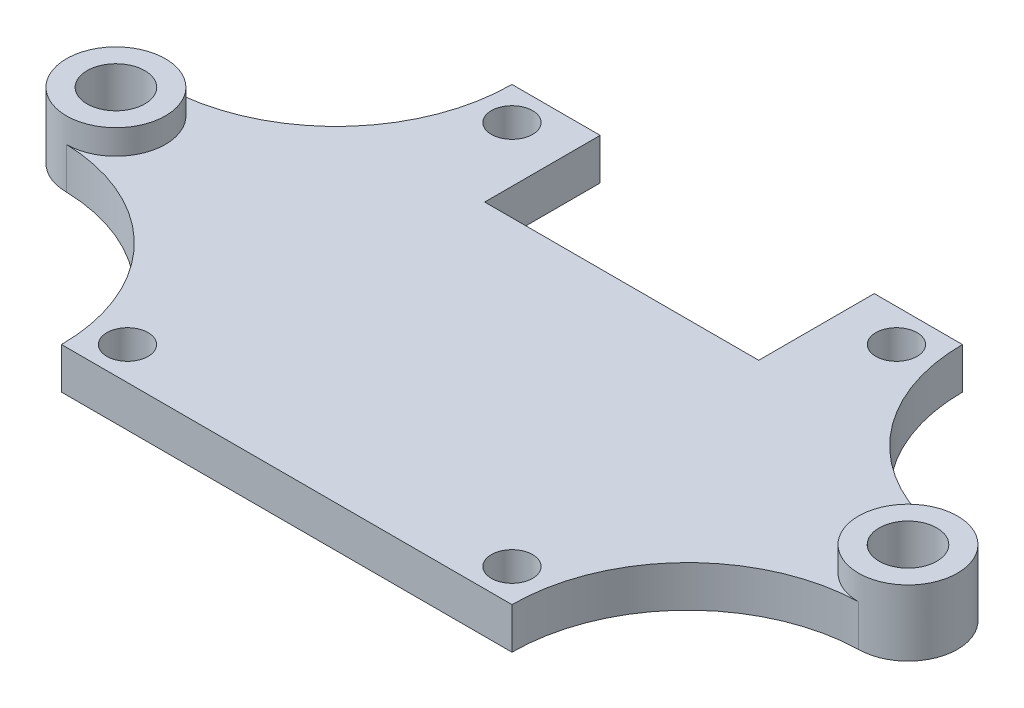
ISO-10303-21;
HEADER;
FILE_DESCRIPTION(('STEP AP214'),'2;1');
FILE_NAME('part.step','',(''),(''),'','','');
FILE_SCHEMA(('AUTOMOTIVE_DESIGN { 1 0 10303 214 1 1 1 1 }'));
ENDSEC;
DATA;
#1=APPLICATION_CONTEXT('core data for automotive mechanical design processes');
#2=APPLICATION_PROTOCOL_DEFINITION('international standard','automotive_design',2000,#1);
#3=PRODUCT_CONTEXT('',#1,'mechanical');
#4=PRODUCT('Part','Part','',(#3));
#5=PRODUCT_RELATED_PRODUCT_CATEGORY('part','',(#4));
#6=PRODUCT_DEFINITION_FORMATION('','',#4);
#7=PRODUCT_DEFINITION_CONTEXT('part definition',#1,'design');
#8=PRODUCT_DEFINITION('design','',#6,#7);
#9=PRODUCT_DEFINITION_SHAPE('','',#8);
#10=(LENGTH_UNIT() NAMED_UNIT(*) SI_UNIT(.MILLI.,.METRE.));
#11=(NAMED_UNIT(*) PLANE_ANGLE_UNIT() SI_UNIT($,.RADIAN.));
#12=(NAMED_UNIT(*) SI_UNIT($,.STERADIAN.) SOLID_ANGLE_UNIT());
#13=UNCERTAINTY_MEASURE_WITH_UNIT(LENGTH_MEASURE(1.E-05),#10,'distance_accuracy_value','');
#14=(GEOMETRIC_REPRESENTATION_CONTEXT(3) GLOBAL_UNCERTAINTY_ASSIGNED_CONTEXT((#13)) GLOBAL_UNIT_ASSIGNED_CONTEXT((#10,
#11,#12)) REPRESENTATION_CONTEXT('',''));
#15=CARTESIAN_POINT('',(0.,0.,0.));
#16=DIRECTION('',(0.,0.,1.));
#17=DIRECTION('',(1.,0.,0.));
#18=AXIS2_PLACEMENT_3D('',#15,#16,#17);
#19=CARTESIAN_POINT('',(0.,2.5,-27.3));
#20=DIRECTION('',(0.,0.,-1.));
#21=DIRECTION('',(-1.,0.,0.));
#22=AXIS2_PLACEMENT_3D('',#19,#20,#21);
#23=PLANE('',#22);
#24=DIRECTION('',(0.,1.,0.));
#25=VECTOR('',#24,1.);
#26=CARTESIAN_POINT('',(5.34565217391304,-0.75,-27.3));
#27=LINE('',#26,#25);
#28=CARTESIAN_POINT('',(5.34565217391304,0.,-27.3));
#29=VERTEX_POINT('',#28);
#30=CARTESIAN_POINT('',(5.34565217391304,2.5,-27.3));
#31=VERTEX_POINT('',#30);
#32=EDGE_CURVE('E159',#29,#31,#27,.T.);
#33=ORIENTED_EDGE('',*,*,#32,.F.);
#34=DIRECTION('',(1.,0.,0.));
#35=VECTOR('',#34,1.);
#36=CARTESIAN_POINT('',(0.,0.,-27.3));
#37=LINE('',#36,#35);
#38=CARTESIAN_POINT('',(0.,0.,-27.3));
#39=VERTEX_POINT('',#38);
#40=EDGE_CURVE('E282',#39,#29,#37,.T.);
#41=ORIENTED_EDGE('',*,*,#40,.F.);
#42=DIRECTION('',(0.,-1.,0.));
#43=VECTOR('',#42,1.);
#44=CARTESIAN_POINT('',(0.,2.5,-27.3));
#45=LINE('',#44,#43);
#46=CARTESIAN_POINT('',(0.,2.5,-27.3));
#47=VERTEX_POINT('',#46);
#48=EDGE_CURVE('E303',#47,#39,#45,.T.);
#49=ORIENTED_EDGE('',*,*,#48,.F.);
#50=DIRECTION('',(1.,0.,0.));
#51=VECTOR('',#50,1.);
#52=CARTESIAN_POINT('',(0.,2.5,-27.3));
#53=LINE('',#52,#51);
#54=EDGE_CURVE('E242',#47,#31,#53,.T.);
#55=ORIENTED_EDGE('',*,*,#54,.T.);
#56=EDGE_LOOP('',(#33,#41,#49,#55));
#57=FACE_BOUND('',#56,.T.);
#58=ADVANCED_FACE('F45',(#57),#23,.T.);
#59=CARTESIAN_POINT('',(0.,2.5,0.));
#60=DIRECTION('',(0.,0.,-1.));
#61=DIRECTION('',(-1.,0.,0.));
#62=AXIS2_PLACEMENT_3D('',#59,#60,#61);
#63=PLANE('',#62);
#64=DIRECTION('',(1.,0.,0.));
#65=VECTOR('',#64,1.);
#66=CARTESIAN_POINT('',(0.,0.,0.));
#67=LINE('',#66,#65);
#68=CARTESIAN_POINT('',(0.,0.,0.));
#69=VERTEX_POINT('',#68);
#70=CARTESIAN_POINT('',(27.3,0.,0.));
#71=VERTEX_POINT('',#70);
#72=EDGE_CURVE('E270',#69,#71,#67,.T.);
#73=ORIENTED_EDGE('',*,*,#72,.T.);
#74=DIRECTION('',(0.,-1.,0.));
#75=VECTOR('',#74,1.);
#76=CARTESIAN_POINT('',(27.3,2.5,0.));
#77=LINE('',#76,#75);
#78=CARTESIAN_POINT('',(27.3,2.5,0.));
#79=VERTEX_POINT('',#78);
#80=EDGE_CURVE('E318',#79,#71,#77,.T.);
#81=ORIENTED_EDGE('',*,*,#80,.F.);
#82=DIRECTION('',(1.,0.,0.));
#83=VECTOR('',#82,1.);
#84=CARTESIAN_POINT('',(0.,2.5,0.));
#85=LINE('',#84,#83);
#86=CARTESIAN_POINT('',(0.,2.5,0.));
#87=VERTEX_POINT('',#86);
#88=EDGE_CURVE('E229',#87,#79,#85,.T.);
#89=ORIENTED_EDGE('',*,*,#88,.F.);
#90=DIRECTION('',(0.,-1.,0.));
#91=VECTOR('',#90,1.);
#92=CARTESIAN_POINT('',(0.,2.5,0.));
#93=LINE('',#92,#91);
#94=EDGE_CURVE('E70',#87,#69,#93,.T.);
#95=ORIENTED_EDGE('',*,*,#94,.T.);
#96=EDGE_LOOP('',(#73,#81,#89,#95));
#97=FACE_BOUND('',#96,.T.);
#98=ADVANCED_FACE('F343',(#97),#63,.F.);
#99=CARTESIAN_POINT('',(37.954347826087,2.5,0.));
#100=DIRECTION('',(0.,-1.,0.));
#101=DIRECTION('',(0.,0.,-1.));
#102=AXIS2_PLACEMENT_3D('',#99,#100,#101);
#103=CYLINDRICAL_SURFACE('',#102,10.654347826087);
#104=CARTESIAN_POINT('',(37.954347826087,0.,0.));
#105=DIRECTION('',(0.,1.,0.));
#106=DIRECTION('',(0.,0.,1.));
#107=AXIS2_PLACEMENT_3D('',#104,#105,#106);
#108=CIRCLE('',#107,10.654347826087);
#109=CARTESIAN_POINT('',(37.6499999999999,0.,-10.65));
#110=VERTEX_POINT('',#109);
#111=EDGE_CURVE('E273',#71,#110,#108,.F.);
#112=ORIENTED_EDGE('',*,*,#111,.T.);
#113=DIRECTION('',(0.,-1.,0.));
#114=VECTOR('',#113,1.);
#115=CARTESIAN_POINT('',(37.6499999999999,2.5,-10.65));
#116=LINE('',#115,#114);
#117=CARTESIAN_POINT('',(37.65,2.5,-10.65));
#118=VERTEX_POINT('',#117);
#119=EDGE_CURVE('E314',#118,#110,#116,.T.);
#120=ORIENTED_EDGE('',*,*,#119,.F.);
#121=CARTESIAN_POINT('',(37.954347826087,2.5,0.));
#122=DIRECTION('',(0.,1.,0.));
#123=DIRECTION('',(0.,0.,1.));
#124=AXIS2_PLACEMENT_3D('',#121,#122,#123);
#125=CIRCLE('',#124,10.654347826087);
#126=EDGE_CURVE('E103',#79,#118,#125,.F.);
#127=ORIENTED_EDGE('',*,*,#126,.F.);
#128=ORIENTED_EDGE('',*,*,#80,.T.);
#129=EDGE_LOOP('',(#112,#120,#127,#128));
#130=FACE_BOUND('',#129,.T.);
#131=ADVANCED_FACE('F342',(#130),#103,.F.);
#132=CARTESIAN_POINT('',(37.954347826087,2.5,-27.3));
#133=DIRECTION('',(0.,-1.,0.));
#134=DIRECTION('',(0.,0.,-1.));
#135=AXIS2_PLACEMENT_3D('',#132,#133,#134);
#136=CYLINDRICAL_SURFACE('',#135,10.654347826087);
#137=CARTESIAN_POINT('',(37.954347826087,0.,-27.3));
#138=DIRECTION('',(0.,1.,0.));
#139=DIRECTION('',(0.,0.,1.));
#140=AXIS2_PLACEMENT_3D('',#137,#138,#139);
#141=CIRCLE('',#140,10.654347826087);
#142=CARTESIAN_POINT('',(27.3,0.,-27.3));
#143=VERTEX_POINT('',#142);
#144=CARTESIAN_POINT('',(37.65,0.,-16.65));
#145=VERTEX_POINT('',#144);
#146=EDGE_CURVE('E277',#143,#145,#141,.T.);
#147=ORIENTED_EDGE('',*,*,#146,.F.);
#148=DIRECTION('',(0.,-1.,0.));
#149=VECTOR('',#148,1.);
#150=CARTESIAN_POINT('',(27.3,2.5,-27.3));
#151=LINE('',#150,#149);
#152=CARTESIAN_POINT('',(27.3,2.5,-27.3));
#153=VERTEX_POINT('',#152);
#154=EDGE_CURVE('E306',#153,#143,#151,.T.);
#155=ORIENTED_EDGE('',*,*,#154,.F.);
#156=CARTESIAN_POINT('',(37.954347826087,2.5,-27.3));
#157=DIRECTION('',(0.,1.,0.));
#158=DIRECTION('',(0.,0.,1.));
#159=AXIS2_PLACEMENT_3D('',#156,#157,#158);
#160=CIRCLE('',#159,10.654347826087);
#161=CARTESIAN_POINT('',(37.6499999999998,2.5,-16.65));
#162=VERTEX_POINT('',#161);
#163=EDGE_CURVE('E237',#153,#162,#160,.T.);
#164=ORIENTED_EDGE('',*,*,#163,.T.);
#165=DIRECTION('',(0.,-1.,0.));
#166=VECTOR('',#165,1.);
#167=CARTESIAN_POINT('',(37.6499999999998,2.5,-16.65));
#168=LINE('',#167,#166);
#169=EDGE_CURVE('E310',#162,#145,#168,.T.);
#170=ORIENTED_EDGE('',*,*,#169,.T.);
#171=EDGE_LOOP('',(#147,#155,#164,#170));
#172=FACE_BOUND('',#171,.T.);
#173=ADVANCED_FACE('F337',(#172),#136,.F.);
#174=DIRECTION('',(0.,1.,0.));
#175=VECTOR('',#174,1.);
#176=CARTESIAN_POINT('',(21.954347826087,-0.75,-27.3));
#177=LINE('',#176,#175);
#178=CARTESIAN_POINT('',(21.954347826087,0.,-27.3));
#179=VERTEX_POINT('',#178);
#180=CARTESIAN_POINT('',(21.954347826087,2.5,-27.3));
#181=VERTEX_POINT('',#180);
#182=EDGE_CURVE('E176',#179,#181,#177,.T.);
#183=ORIENTED_EDGE('',*,*,#182,.T.);
#184=EDGE_CURVE('E241',#181,#153,#53,.T.);
#185=ORIENTED_EDGE('',*,*,#184,.T.);
#186=ORIENTED_EDGE('',*,*,#154,.T.);
#187=EDGE_CURVE('E281',#179,#143,#37,.T.);
#188=ORIENTED_EDGE('',*,*,#187,.F.);
#189=EDGE_LOOP('',(#183,#185,#186,#188));
#190=FACE_BOUND('',#189,.T.);
#191=ADVANCED_FACE('F330',(#190),#23,.T.);
#192=CARTESIAN_POINT('',(-10.654347826087,2.5,-27.3));
#193=DIRECTION('',(0.,-1.,0.));
#194=DIRECTION('',(0.,0.,-1.));
#195=AXIS2_PLACEMENT_3D('',#192,#193,#194);
#196=CYLINDRICAL_SURFACE('',#195,10.654347826087);
#197=CARTESIAN_POINT('',(-10.654347826087,0.,-27.3));
#198=DIRECTION('',(0.,1.,0.));
#199=DIRECTION('',(0.,0.,1.));
#200=AXIS2_PLACEMENT_3D('',#197,#198,#199);
#201=CIRCLE('',#200,10.654347826087);
#202=CARTESIAN_POINT('',(-10.35,0.,-16.65));
#203=VERTEX_POINT('',#202);
#204=EDGE_CURVE('E286',#39,#203,#201,.F.);
#205=ORIENTED_EDGE('',*,*,#204,.T.);
#206=DIRECTION('',(0.,-1.,0.));
#207=VECTOR('',#206,1.);
#208=CARTESIAN_POINT('',(-10.35,2.5,-16.65));
#209=LINE('',#208,#207);
#210=CARTESIAN_POINT('',(-10.35,2.5,-16.65));
#211=VERTEX_POINT('',#210);
#212=EDGE_CURVE('E299',#211,#203,#209,.T.);
#213=ORIENTED_EDGE('',*,*,#212,.F.);
#214=CARTESIAN_POINT('',(-10.654347826087,2.5,-27.3));
#215=DIRECTION('',(0.,1.,0.));
#216=DIRECTION('',(0.,0.,1.));
#217=AXIS2_PLACEMENT_3D('',#214,#215,#216);
#218=CIRCLE('',#217,10.654347826087);
#219=EDGE_CURVE('E245',#47,#211,#218,.F.);
#220=ORIENTED_EDGE('',*,*,#219,.F.);
#221=ORIENTED_EDGE('',*,*,#48,.T.);
#222=EDGE_LOOP('',(#205,#213,#220,#221));
#223=FACE_BOUND('',#222,.T.);
#224=ADVANCED_FACE('F359',(#223),#196,.F.);
#225=CARTESIAN_POINT('',(2.,2.5,-25.3));
#226=DIRECTION('',(0.,-1.,0.));
#227=DIRECTION('',(0.,0.,-1.));
#228=AXIS2_PLACEMENT_3D('',#225,#226,#227);
#229=CYLINDRICAL_SURFACE('',#228,1.25);
#230=CARTESIAN_POINT('',(2.,2.5,-25.3));
#231=DIRECTION('',(0.,1.,0.));
#232=DIRECTION('',(0.,0.,1.));
#233=AXIS2_PLACEMENT_3D('',#230,#231,#232);
#234=CIRCLE('',#233,1.25);
#235=CARTESIAN_POINT('',(2.,2.5,-24.05));
#236=VERTEX_POINT('',#235);
#237=EDGE_CURVE('E225',#236,#236,#234,.T.);
#238=ORIENTED_EDGE('',*,*,#237,.T.);
#239=EDGE_LOOP('',(#238));
#240=FACE_BOUND('',#239,.T.);
#241=CARTESIAN_POINT('',(2.,0.,-25.3));
#242=DIRECTION('',(0.,1.,0.));
#243=DIRECTION('',(0.,0.,1.));
#244=AXIS2_PLACEMENT_3D('',#241,#242,#243);
#245=CIRCLE('',#244,1.25);
#246=CARTESIAN_POINT('',(2.,0.,-24.05));
#247=VERTEX_POINT('',#246);
#248=EDGE_CURVE('E266',#247,#247,#245,.T.);
#249=ORIENTED_EDGE('',*,*,#248,.F.);
#250=EDGE_LOOP('',(#249));
#251=FACE_BOUND('',#250,.T.);
#252=ADVANCED_FACE('F356',(#240,#251),#229,.F.);
#253=CARTESIAN_POINT('',(25.3,2.5,-2.));
#254=DIRECTION('',(0.,-1.,0.));
#255=DIRECTION('',(0.,0.,-1.));
#256=AXIS2_PLACEMENT_3D('',#253,#254,#255);
#257=CYLINDRICAL_SURFACE('',#256,1.25);
#258=CARTESIAN_POINT('',(25.3,2.5,-2.));
#259=DIRECTION('',(0.,1.,0.));
#260=DIRECTION('',(0.,0.,1.));
#261=AXIS2_PLACEMENT_3D('',#258,#259,#260);
#262=CIRCLE('',#261,1.25);
#263=CARTESIAN_POINT('',(25.3,2.5,-0.750000000000001));
#264=VERTEX_POINT('',#263);
#265=EDGE_CURVE('E221',#264,#264,#262,.T.);
#266=ORIENTED_EDGE('',*,*,#265,.T.);
#267=EDGE_LOOP('',(#266));
#268=FACE_BOUND('',#267,.T.);
#269=CARTESIAN_POINT('',(25.3,0.,-2.));
#270=DIRECTION('',(0.,1.,0.));
#271=DIRECTION('',(0.,0.,1.));
#272=AXIS2_PLACEMENT_3D('',#269,#270,#271);
#273=CIRCLE('',#272,1.25);
#274=CARTESIAN_POINT('',(25.3,0.,-0.750000000000001));
#275=VERTEX_POINT('',#274);
#276=EDGE_CURVE('E262',#275,#275,#273,.T.);
#277=ORIENTED_EDGE('',*,*,#276,.F.);
#278=EDGE_LOOP('',(#277));
#279=FACE_BOUND('',#278,.T.);
#280=ADVANCED_FACE('F358',(#268,#279),#257,.F.);
#281=CARTESIAN_POINT('',(25.3,2.5,-25.3));
#282=DIRECTION('',(0.,-1.,0.));
#283=DIRECTION('',(0.,0.,-1.));
#284=AXIS2_PLACEMENT_3D('',#281,#282,#283);
#285=CYLINDRICAL_SURFACE('',#284,1.25);
#286=CARTESIAN_POINT('',(25.3,2.5,-25.3));
#287=DIRECTION('',(0.,1.,0.));
#288=DIRECTION('',(0.,0.,1.));
#289=AXIS2_PLACEMENT_3D('',#286,#287,#288);
#290=CIRCLE('',#289,1.25);
#291=CARTESIAN_POINT('',(25.3,2.5,-24.05));
#292=VERTEX_POINT('',#291);
#293=EDGE_CURVE('E216',#292,#292,#290,.T.);
#294=ORIENTED_EDGE('',*,*,#293,.T.);
#295=EDGE_LOOP('',(#294));
#296=FACE_BOUND('',#295,.T.);
#297=CARTESIAN_POINT('',(25.3,0.,-25.3));
#298=DIRECTION('',(0.,1.,0.));
#299=DIRECTION('',(0.,0.,1.));
#300=AXIS2_PLACEMENT_3D('',#297,#298,#299);
#301=CIRCLE('',#300,1.25);
#302=CARTESIAN_POINT('',(25.3,0.,-24.05));
#303=VERTEX_POINT('',#302);
#304=EDGE_CURVE('E258',#303,#303,#301,.T.);
#305=ORIENTED_EDGE('',*,*,#304,.F.);
#306=EDGE_LOOP('',(#305));
#307=FACE_BOUND('',#306,.T.);
#308=ADVANCED_FACE('F362',(#296,#307),#285,.F.);
#309=CARTESIAN_POINT('',(2.,2.5,-2.));
#310=DIRECTION('',(0.,-1.,0.));
#311=DIRECTION('',(0.,0.,-1.));
#312=AXIS2_PLACEMENT_3D('',#309,#310,#311);
#313=CYLINDRICAL_SURFACE('',#312,1.25);
#314=CARTESIAN_POINT('',(2.,2.5,-2.));
#315=DIRECTION('',(0.,1.,0.));
#316=DIRECTION('',(0.,0.,1.));
#317=AXIS2_PLACEMENT_3D('',#314,#315,#316);
#318=CIRCLE('',#317,1.25);
#319=CARTESIAN_POINT('',(2.,2.5,-0.750000000000002));
#320=VERTEX_POINT('',#319);
#321=EDGE_CURVE('E212',#320,#320,#318,.T.);
#322=ORIENTED_EDGE('',*,*,#321,.T.);
#323=EDGE_LOOP('',(#322));
#324=FACE_BOUND('',#323,.T.);
#325=CARTESIAN_POINT('',(2.,0.,-2.));
#326=DIRECTION('',(0.,1.,0.));
#327=DIRECTION('',(0.,0.,1.));
#328=AXIS2_PLACEMENT_3D('',#325,#326,#327);
#329=CIRCLE('',#328,1.25);
#330=CARTESIAN_POINT('',(2.,0.,-0.750000000000002));
#331=VERTEX_POINT('',#330);
#332=EDGE_CURVE('E191',#331,#331,#329,.T.);
#333=ORIENTED_EDGE('',*,*,#332,.F.);
#334=EDGE_LOOP('',(#333));
#335=FACE_BOUND('',#334,.T.);
#336=ADVANCED_FACE('F47',(#324,#335),#313,.F.);
#337=CARTESIAN_POINT('',(-10.654347826087,2.5,0.));
#338=DIRECTION('',(0.,-1.,0.));
#339=DIRECTION('',(0.,0.,-1.));
#340=AXIS2_PLACEMENT_3D('',#337,#338,#339);
#341=CYLINDRICAL_SURFACE('',#340,10.654347826087);
#342=CARTESIAN_POINT('',(-10.654347826087,0.,0.));
#343=DIRECTION('',(0.,1.,0.));
#344=DIRECTION('',(0.,0.,1.));
#345=AXIS2_PLACEMENT_3D('',#342,#343,#344);
#346=CIRCLE('',#345,10.654347826087);
#347=CARTESIAN_POINT('',(-10.35,0.,-10.65));
#348=VERTEX_POINT('',#347);
#349=EDGE_CURVE('E217',#69,#348,#346,.T.);
#350=ORIENTED_EDGE('',*,*,#349,.F.);
#351=ORIENTED_EDGE('',*,*,#94,.F.);
#352=CARTESIAN_POINT('',(-10.654347826087,2.5,0.));
#353=DIRECTION('',(0.,1.,0.));
#354=DIRECTION('',(0.,0.,1.));
#355=AXIS2_PLACEMENT_3D('',#352,#353,#354);
#356=CIRCLE('',#355,10.654347826087);
#357=CARTESIAN_POINT('',(-10.35,2.5,-10.65));
#358=VERTEX_POINT('',#357);
#359=EDGE_CURVE('E252',#87,#358,#356,.T.);
#360=ORIENTED_EDGE('',*,*,#359,.T.);
#361=DIRECTION('',(0.,-1.,0.));
#362=VECTOR('',#361,1.);
#363=CARTESIAN_POINT('',(-10.35,2.5,-10.65));
#364=LINE('',#363,#362);
#365=EDGE_CURVE('E295',#358,#348,#364,.T.);
#366=ORIENTED_EDGE('',*,*,#365,.T.);
#367=EDGE_LOOP('',(#350,#351,#360,#366));
#368=FACE_BOUND('',#367,.T.);
#369=ADVANCED_FACE('F369',(#368),#341,.F.);
#370=CARTESIAN_POINT('',(0.,2.5,0.));
#371=DIRECTION('',(0.,1.,0.));
#372=DIRECTION('',(0.,0.,1.));
#373=AXIS2_PLACEMENT_3D('',#370,#371,#372);
#374=PLANE('',#373);
#375=DIRECTION('',(0.,0.,1.));
#376=VECTOR('',#375,1.);
#377=CARTESIAN_POINT('',(5.34565217391304,2.5,-27.3));
#378=LINE('',#377,#376);
#379=CARTESIAN_POINT('',(5.34565217391304,2.5,-20.3));
#380=VERTEX_POINT('',#379);
#381=EDGE_CURVE('E156',#31,#380,#378,.T.);
#382=ORIENTED_EDGE('',*,*,#381,.F.);
#383=ORIENTED_EDGE('',*,*,#54,.F.);
#384=ORIENTED_EDGE('',*,*,#219,.T.);
#385=CARTESIAN_POINT('',(-10.35,2.5,-13.65));
#386=DIRECTION('',(0.,1.,0.));
#387=DIRECTION('',(0.,0.,1.));
#388=AXIS2_PLACEMENT_3D('',#385,#386,#387);
#389=CIRCLE('',#388,3.);
#390=EDGE_CURVE('E249',#358,#211,#389,.T.);
#391=ORIENTED_EDGE('',*,*,#390,.F.);
#392=ORIENTED_EDGE('',*,*,#359,.F.);
#393=ORIENTED_EDGE('',*,*,#88,.T.);
#394=ORIENTED_EDGE('',*,*,#126,.T.);
#395=CARTESIAN_POINT('',(37.65,2.5,-13.65));
#396=DIRECTION('',(0.,1.,0.));
#397=DIRECTION('',(0.,0.,1.));
#398=AXIS2_PLACEMENT_3D('',#395,#396,#397);
#399=CIRCLE('',#398,3.);
#400=EDGE_CURVE('E234',#162,#118,#399,.T.);
#401=ORIENTED_EDGE('',*,*,#400,.F.);
#402=ORIENTED_EDGE('',*,*,#163,.F.);
#403=ORIENTED_EDGE('',*,*,#184,.F.);
#404=DIRECTION('',(0.,0.,-1.));
#405=VECTOR('',#404,1.);
#406=CARTESIAN_POINT('',(21.954347826087,2.5,-27.3));
#407=LINE('',#406,#405);
#408=CARTESIAN_POINT('',(21.954347826087,2.5,-20.3));
#409=VERTEX_POINT('',#408);
#410=EDGE_CURVE('E153',#409,#181,#407,.T.);
#411=ORIENTED_EDGE('',*,*,#410,.F.);
#412=DIRECTION('',(1.,0.,0.));
#413=VECTOR('',#412,1.);
#414=CARTESIAN_POINT('',(5.34565217391304,2.5,-20.3));
#415=LINE('',#414,#413);
#416=EDGE_CURVE('E147',#380,#409,#415,.T.);
#417=ORIENTED_EDGE('',*,*,#416,.F.);
#418=EDGE_LOOP('',(#382,#383,#384,#391,#392,#393,#394,#401,#402,#403,#411,#417));
#419=FACE_BOUND('',#418,.T.);
#420=ORIENTED_EDGE('',*,*,#321,.F.);
#421=EDGE_LOOP('',(#420));
#422=FACE_BOUND('',#421,.T.);
#423=ORIENTED_EDGE('',*,*,#293,.F.);
#424=EDGE_LOOP('',(#423));
#425=FACE_BOUND('',#424,.T.);
#426=ORIENTED_EDGE('',*,*,#265,.F.);
#427=EDGE_LOOP('',(#426));
#428=FACE_BOUND('',#427,.T.);
#429=ORIENTED_EDGE('',*,*,#237,.F.);
#430=EDGE_LOOP('',(#429));
#431=FACE_BOUND('',#430,.T.);
#432=ADVANCED_FACE('F165',(#419,#422,#425,#428,#431),#374,.T.);
#433=CARTESIAN_POINT('',(0.,0.,0.));
#434=DIRECTION('',(0.,1.,0.));
#435=DIRECTION('',(0.,0.,1.));
#436=AXIS2_PLACEMENT_3D('',#433,#434,#435);
#437=PLANE('',#436);
#438=ORIENTED_EDGE('',*,*,#40,.T.);
#439=DIRECTION('',(0.,0.,1.));
#440=VECTOR('',#439,1.);
#441=CARTESIAN_POINT('',(5.34565217391305,0.,0.));
#442=LINE('',#441,#440);
#443=CARTESIAN_POINT('',(5.34565217391304,0.,-20.3));
#444=VERTEX_POINT('',#443);
#445=EDGE_CURVE('E11',#29,#444,#442,.T.);
#446=ORIENTED_EDGE('',*,*,#445,.T.);
#447=DIRECTION('',(1.,0.,0.));
#448=VECTOR('',#447,1.);
#449=CARTESIAN_POINT('',(0.,0.,-20.3));
#450=LINE('',#449,#448);
#451=CARTESIAN_POINT('',(21.954347826087,0.,-20.3));
#452=VERTEX_POINT('',#451);
#453=EDGE_CURVE('E150',#444,#452,#450,.T.);
#454=ORIENTED_EDGE('',*,*,#453,.T.);
#455=DIRECTION('',(0.,0.,-1.));
#456=VECTOR('',#455,1.);
#457=CARTESIAN_POINT('',(21.954347826087,0.,0.));
#458=LINE('',#457,#456);
#459=EDGE_CURVE('E54',#452,#179,#458,.T.);
#460=ORIENTED_EDGE('',*,*,#459,.T.);
#461=ORIENTED_EDGE('',*,*,#187,.T.);
#462=ORIENTED_EDGE('',*,*,#146,.T.);
#463=CARTESIAN_POINT('',(37.65,0.,-13.65));
#464=DIRECTION('',(0.,1.,0.));
#465=DIRECTION('',(0.,0.,1.));
#466=AXIS2_PLACEMENT_3D('',#463,#464,#465);
#467=CIRCLE('',#466,3.);
#468=EDGE_CURVE('E203',#110,#145,#467,.T.);
#469=ORIENTED_EDGE('',*,*,#468,.F.);
#470=ORIENTED_EDGE('',*,*,#111,.F.);
#471=ORIENTED_EDGE('',*,*,#72,.F.);
#472=ORIENTED_EDGE('',*,*,#349,.T.);
#473=CARTESIAN_POINT('',(-10.35,0.,-13.65));
#474=DIRECTION('',(0.,1.,0.));
#475=DIRECTION('',(0.,0.,1.));
#476=AXIS2_PLACEMENT_3D('',#473,#474,#475);
#477=CIRCLE('',#476,3.);
#478=EDGE_CURVE('E187',#203,#348,#477,.T.);
#479=ORIENTED_EDGE('',*,*,#478,.F.);
#480=ORIENTED_EDGE('',*,*,#204,.F.);
#481=EDGE_LOOP('',(#438,#446,#454,#460,#461,#462,#469,#470,#471,#472,#479,#480));
#482=FACE_BOUND('',#481,.T.);
#483=ORIENTED_EDGE('',*,*,#332,.T.);
#484=EDGE_LOOP('',(#483));
#485=FACE_BOUND('',#484,.T.);
#486=ORIENTED_EDGE('',*,*,#304,.T.);
#487=EDGE_LOOP('',(#486));
#488=FACE_BOUND('',#487,.T.);
#489=ORIENTED_EDGE('',*,*,#276,.T.);
#490=EDGE_LOOP('',(#489));
#491=FACE_BOUND('',#490,.T.);
#492=ORIENTED_EDGE('',*,*,#248,.T.);
#493=EDGE_LOOP('',(#492));
#494=FACE_BOUND('',#493,.T.);
#495=CARTESIAN_POINT('',(37.65,0.,-13.65));
#496=DIRECTION('',(0.,1.,0.));
#497=DIRECTION('',(0.,0.,1.));
#498=AXIS2_PLACEMENT_3D('',#495,#496,#497);
#499=CIRCLE('',#498,1.75);
#500=CARTESIAN_POINT('',(37.65,0.,-11.9));
#501=VERTEX_POINT('',#500);
#502=EDGE_CURVE('E175',#501,#501,#499,.T.);
#503=ORIENTED_EDGE('',*,*,#502,.T.);
#504=EDGE_LOOP('',(#503));
#505=FACE_BOUND('',#504,.T.);
#506=CARTESIAN_POINT('',(-10.35,0.,-13.65));
#507=DIRECTION('',(0.,1.,0.));
#508=DIRECTION('',(0.,0.,1.));
#509=AXIS2_PLACEMENT_3D('',#506,#507,#508);
#510=CIRCLE('',#509,1.75);
#511=CARTESIAN_POINT('',(-10.35,0.,-11.9));
#512=VERTEX_POINT('',#511);
#513=EDGE_CURVE('E192',#512,#512,#510,.T.);
#514=ORIENTED_EDGE('',*,*,#513,.T.);
#515=EDGE_LOOP('',(#514));
#516=FACE_BOUND('',#515,.T.);
#517=ADVANCED_FACE('F326',(#482,#485,#488,#491,#494,#505,#516),#437,.F.);
#518=CARTESIAN_POINT('',(37.65,4.,-13.65));
#519=DIRECTION('',(0.,-1.,0.));
#520=DIRECTION('',(0.,0.,-1.));
#521=AXIS2_PLACEMENT_3D('',#518,#519,#520);
#522=CYLINDRICAL_SURFACE('',#521,3.);
#523=CARTESIAN_POINT('',(37.65,4.,-13.65));
#524=DIRECTION('',(0.,1.,0.));
#525=DIRECTION('',(0.,0.,1.));
#526=AXIS2_PLACEMENT_3D('',#523,#524,#525);
#527=CIRCLE('',#526,3.);
#528=CARTESIAN_POINT('',(37.65,4.,-10.65));
#529=VERTEX_POINT('',#528);
#530=EDGE_CURVE('E196',#529,#529,#527,.T.);
#531=ORIENTED_EDGE('',*,*,#530,.F.);
#532=EDGE_LOOP('',(#531));
#533=FACE_BOUND('',#532,.T.);
#534=ORIENTED_EDGE('',*,*,#400,.T.);
#535=ORIENTED_EDGE('',*,*,#119,.T.);
#536=ORIENTED_EDGE('',*,*,#468,.T.);
#537=ORIENTED_EDGE('',*,*,#169,.F.);
#538=EDGE_LOOP('',(#534,#535,#536,#537));
#539=FACE_BOUND('',#538,.T.);
#540=ADVANCED_FACE('F340',(#533,#539),#522,.T.);
#541=CARTESIAN_POINT('',(37.65,4.,-13.65));
#542=DIRECTION('',(0.,-1.,0.));
#543=DIRECTION('',(0.,0.,-1.));
#544=AXIS2_PLACEMENT_3D('',#541,#542,#543);
#545=CYLINDRICAL_SURFACE('',#544,1.75);
#546=CARTESIAN_POINT('',(37.65,4.,-13.65));
#547=DIRECTION('',(0.,1.,0.));
#548=DIRECTION('',(0.,0.,1.));
#549=AXIS2_PLACEMENT_3D('',#546,#547,#548);
#550=CIRCLE('',#549,1.75);
#551=CARTESIAN_POINT('',(37.65,4.,-11.9));
#552=VERTEX_POINT('',#551);
#553=EDGE_CURVE('E199',#552,#552,#550,.T.);
#554=ORIENTED_EDGE('',*,*,#553,.T.);
#555=EDGE_LOOP('',(#554));
#556=FACE_BOUND('',#555,.T.);
#557=ORIENTED_EDGE('',*,*,#502,.F.);
#558=EDGE_LOOP('',(#557));
#559=FACE_BOUND('',#558,.T.);
#560=ADVANCED_FACE('F404',(#556,#559),#545,.F.);
#561=CARTESIAN_POINT('',(0.,4.,0.));
#562=DIRECTION('',(0.,1.,0.));
#563=DIRECTION('',(0.,0.,1.));
#564=AXIS2_PLACEMENT_3D('',#561,#562,#563);
#565=PLANE('',#564);
#566=ORIENTED_EDGE('',*,*,#553,.F.);
#567=EDGE_LOOP('',(#566));
#568=FACE_BOUND('',#567,.T.);
#569=ORIENTED_EDGE('',*,*,#530,.T.);
#570=EDGE_LOOP('',(#569));
#571=FACE_BOUND('',#570,.T.);
#572=ADVANCED_FACE('F398',(#568,#571),#565,.T.);
#573=CARTESIAN_POINT('',(-10.35,4.,-13.65));
#574=DIRECTION('',(0.,-1.,0.));
#575=DIRECTION('',(0.,0.,-1.));
#576=AXIS2_PLACEMENT_3D('',#573,#574,#575);
#577=CYLINDRICAL_SURFACE('',#576,3.);
#578=CARTESIAN_POINT('',(-10.35,4.,-13.65));
#579=DIRECTION('',(0.,1.,0.));
#580=DIRECTION('',(0.,0.,1.));
#581=AXIS2_PLACEMENT_3D('',#578,#579,#580);
#582=CIRCLE('',#581,3.);
#583=CARTESIAN_POINT('',(-10.35,4.,-10.65));
#584=VERTEX_POINT('',#583);
#585=EDGE_CURVE('E186',#584,#584,#582,.T.);
#586=ORIENTED_EDGE('',*,*,#585,.F.);
#587=EDGE_LOOP('',(#586));
#588=FACE_BOUND('',#587,.T.);
#589=ORIENTED_EDGE('',*,*,#390,.T.);
#590=ORIENTED_EDGE('',*,*,#212,.T.);
#591=ORIENTED_EDGE('',*,*,#478,.T.);
#592=ORIENTED_EDGE('',*,*,#365,.F.);
#593=EDGE_LOOP('',(#589,#590,#591,#592));
#594=FACE_BOUND('',#593,.T.);
#595=ADVANCED_FACE('F389',(#588,#594),#577,.T.);
#596=CARTESIAN_POINT('',(-10.35,4.,-13.65));
#597=DIRECTION('',(0.,-1.,0.));
#598=DIRECTION('',(0.,0.,-1.));
#599=AXIS2_PLACEMENT_3D('',#596,#597,#598);
#600=CYLINDRICAL_SURFACE('',#599,1.75);
#601=CARTESIAN_POINT('',(-10.35,4.,-13.65));
#602=DIRECTION('',(0.,1.,0.));
#603=DIRECTION('',(0.,0.,1.));
#604=AXIS2_PLACEMENT_3D('',#601,#602,#603);
#605=CIRCLE('',#604,1.75);
#606=CARTESIAN_POINT('',(-10.35,4.,-11.9));
#607=VERTEX_POINT('',#606);
#608=EDGE_CURVE('E182',#607,#607,#605,.T.);
#609=ORIENTED_EDGE('',*,*,#608,.T.);
#610=EDGE_LOOP('',(#609));
#611=FACE_BOUND('',#610,.T.);
#612=ORIENTED_EDGE('',*,*,#513,.F.);
#613=EDGE_LOOP('',(#612));
#614=FACE_BOUND('',#613,.T.);
#615=ADVANCED_FACE('F386',(#611,#614),#600,.F.);
#616=CARTESIAN_POINT('',(0.,4.,0.));
#617=DIRECTION('',(0.,1.,0.));
#618=DIRECTION('',(0.,0.,1.));
#619=AXIS2_PLACEMENT_3D('',#616,#617,#618);
#620=PLANE('',#619);
#621=ORIENTED_EDGE('',*,*,#608,.F.);
#622=EDGE_LOOP('',(#621));
#623=FACE_BOUND('',#622,.T.);
#624=ORIENTED_EDGE('',*,*,#585,.T.);
#625=EDGE_LOOP('',(#624));
#626=FACE_BOUND('',#625,.T.);
#627=ADVANCED_FACE('F388',(#623,#626),#620,.T.);
#628=CARTESIAN_POINT('',(5.34565217391304,-0.75,-27.3));
#629=DIRECTION('',(-1.,0.,0.));
#630=DIRECTION('',(0.,0.,1.));
#631=AXIS2_PLACEMENT_3D('',#628,#629,#630);
#632=PLANE('',#631);
#633=ORIENTED_EDGE('',*,*,#32,.T.);
#634=ORIENTED_EDGE('',*,*,#381,.T.);
#635=DIRECTION('',(0.,1.,0.));
#636=VECTOR('',#635,1.);
#637=CARTESIAN_POINT('',(5.34565217391304,-0.75,-20.3));
#638=LINE('',#637,#636);
#639=EDGE_CURVE('E143',#444,#380,#638,.T.);
#640=ORIENTED_EDGE('',*,*,#639,.F.);
#641=ORIENTED_EDGE('',*,*,#445,.F.);
#642=EDGE_LOOP('',(#633,#634,#640,#641));
#643=FACE_BOUND('',#642,.T.);
#644=ADVANCED_FACE('F157',(#643),#632,.F.);
#645=CARTESIAN_POINT('',(21.954347826087,-0.75,-27.3));
#646=DIRECTION('',(1.,0.,0.));
#647=DIRECTION('',(0.,0.,-1.));
#648=AXIS2_PLACEMENT_3D('',#645,#646,#647);
#649=PLANE('',#648);
#650=DIRECTION('',(0.,1.,0.));
#651=VECTOR('',#650,1.);
#652=CARTESIAN_POINT('',(21.954347826087,-0.75,-20.3));
#653=LINE('',#652,#651);
#654=EDGE_CURVE('E61',#452,#409,#653,.T.);
#655=ORIENTED_EDGE('',*,*,#654,.T.);
#656=ORIENTED_EDGE('',*,*,#410,.T.);
#657=ORIENTED_EDGE('',*,*,#182,.F.);
#658=ORIENTED_EDGE('',*,*,#459,.F.);
#659=EDGE_LOOP('',(#655,#656,#657,#658));
#660=FACE_BOUND('',#659,.T.);
#661=ADVANCED_FACE('F484',(#660),#649,.F.);
#662=CARTESIAN_POINT('',(5.34565217391304,-0.75,-20.3));
#663=DIRECTION('',(0.,0.,1.));
#664=DIRECTION('',(1.,0.,0.));
#665=AXIS2_PLACEMENT_3D('',#662,#663,#664);
#666=PLANE('',#665);
#667=ORIENTED_EDGE('',*,*,#639,.T.);
#668=ORIENTED_EDGE('',*,*,#416,.T.);
#669=ORIENTED_EDGE('',*,*,#654,.F.);
#670=ORIENTED_EDGE('',*,*,#453,.F.);
#671=EDGE_LOOP('',(#667,#668,#669,#670));
#672=FACE_BOUND('',#671,.T.);
#673=ADVANCED_FACE('F145',(#672),#666,.F.);
#674=CLOSED_SHELL('',(#58,#98,#131,#173,#191,#224,#252,#280,#308,#336,#369,#432,#517,#540,#560,
#572,#595,#615,#627,#644,#661,#673));
#675=MANIFOLD_SOLID_BREP('B2',#674);
#676=ADVANCED_BREP_SHAPE_REPRESENTATION('',(#18,#675),#14);
#677=SHAPE_DEFINITION_REPRESENTATION(#9,#676);
ENDSEC;
END-ISO-10303-21;
